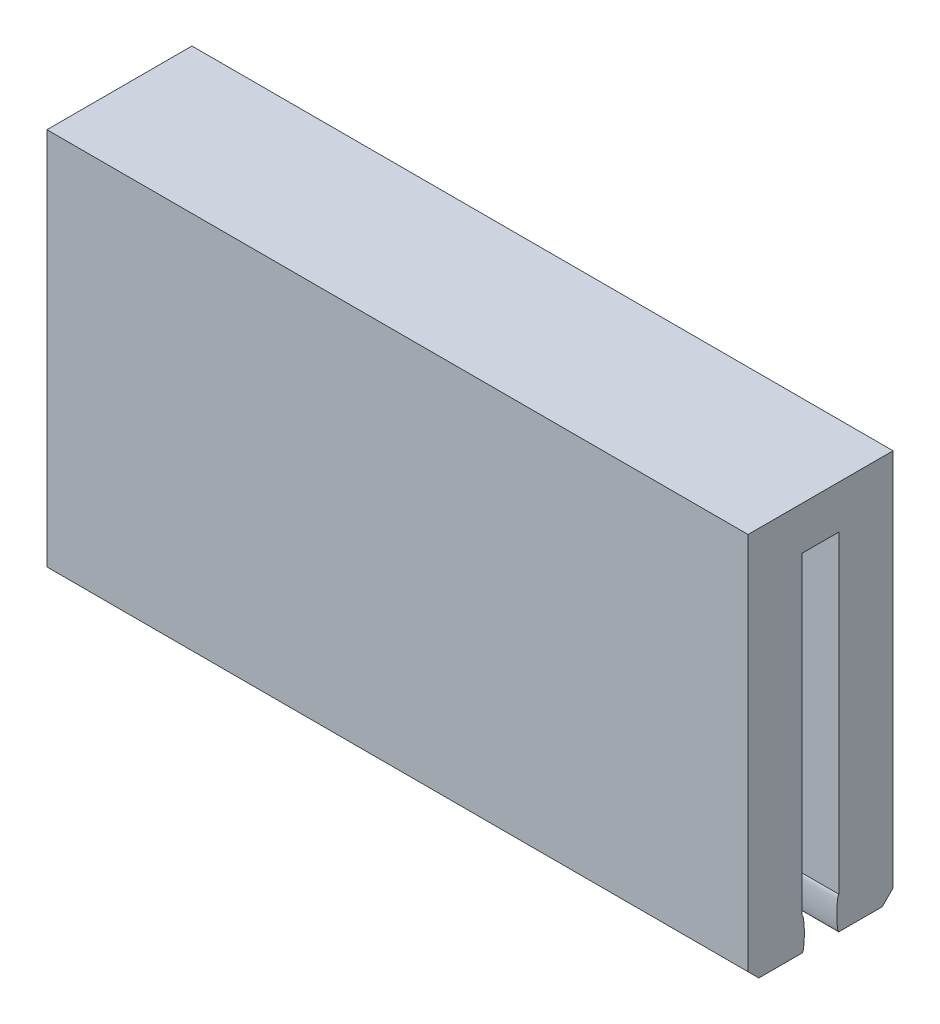
ISO-10303-21;
HEADER;
FILE_DESCRIPTION(('STEP AP214'),'2;1');
FILE_NAME('part.step','',(''),(''),'','','');
FILE_SCHEMA(('AUTOMOTIVE_DESIGN { 1 0 10303 214 1 1 1 1 }'));
ENDSEC;
DATA;
#1=APPLICATION_CONTEXT('core data for automotive mechanical design processes');
#2=APPLICATION_PROTOCOL_DEFINITION('international standard','automotive_design',2000,#1);
#3=PRODUCT_CONTEXT('',#1,'mechanical');
#4=PRODUCT('Part','Part','',(#3));
#5=PRODUCT_RELATED_PRODUCT_CATEGORY('part','',(#4));
#6=PRODUCT_DEFINITION_FORMATION('','',#4);
#7=PRODUCT_DEFINITION_CONTEXT('part definition',#1,'design');
#8=PRODUCT_DEFINITION('design','',#6,#7);
#9=PRODUCT_DEFINITION_SHAPE('','',#8);
#10=(LENGTH_UNIT() NAMED_UNIT(*) SI_UNIT(.MILLI.,.METRE.));
#11=(NAMED_UNIT(*) PLANE_ANGLE_UNIT() SI_UNIT($,.RADIAN.));
#12=(NAMED_UNIT(*) SI_UNIT($,.STERADIAN.) SOLID_ANGLE_UNIT());
#13=UNCERTAINTY_MEASURE_WITH_UNIT(LENGTH_MEASURE(1.E-05),#10,'distance_accuracy_value','');
#14=(GEOMETRIC_REPRESENTATION_CONTEXT(3) GLOBAL_UNCERTAINTY_ASSIGNED_CONTEXT((#13)) GLOBAL_UNIT_ASSIGNED_CONTEXT((#10,
#11,#12)) REPRESENTATION_CONTEXT('',''));
#15=CARTESIAN_POINT('',(0.,0.,0.));
#16=DIRECTION('',(0.,0.,1.));
#17=DIRECTION('',(1.,0.,0.));
#18=AXIS2_PLACEMENT_3D('',#15,#16,#17);
#19=CARTESIAN_POINT('',(0.,16.,0.));
#20=DIRECTION('',(0.,-1.,0.));
#21=DIRECTION('',(0.,0.,-1.));
#22=AXIS2_PLACEMENT_3D('',#19,#20,#21);
#23=PLANE('',#22);
#24=DIRECTION('',(0.,0.,1.));
#25=VECTOR('',#24,1.);
#26=CARTESIAN_POINT('',(-16.2,16.,3.35));
#27=LINE('',#26,#25);
#28=CARTESIAN_POINT('',(-16.2,16.,-0.849999999999999));
#29=VERTEX_POINT('',#28);
#30=CARTESIAN_POINT('',(-16.2,16.,0.850000000000006));
#31=VERTEX_POINT('',#30);
#32=EDGE_CURVE('E496',#29,#31,#27,.T.);
#33=ORIENTED_EDGE('',*,*,#32,.F.);
#34=DIRECTION('',(1.,0.,0.));
#35=VECTOR('',#34,1.);
#36=CARTESIAN_POINT('',(-14.2,16.,-0.849999999999999));
#37=LINE('',#36,#35);
#38=CARTESIAN_POINT('',(-14.2,16.,-0.849999999999999));
#39=VERTEX_POINT('',#38);
#40=EDGE_CURVE('E518',#29,#39,#37,.T.);
#41=ORIENTED_EDGE('',*,*,#40,.T.);
#42=DIRECTION('',(0.,0.,-1.));
#43=VECTOR('',#42,1.);
#44=CARTESIAN_POINT('',(-14.2,16.,-1.35));
#45=LINE('',#44,#43);
#46=CARTESIAN_POINT('',(-14.2,16.,-1.35));
#47=VERTEX_POINT('',#46);
#48=EDGE_CURVE('E523',#39,#47,#45,.T.);
#49=ORIENTED_EDGE('',*,*,#48,.T.);
#50=DIRECTION('',(1.,0.,0.));
#51=VECTOR('',#50,1.);
#52=CARTESIAN_POINT('',(-14.2,16.,-1.35));
#53=LINE('',#52,#51);
#54=CARTESIAN_POINT('',(14.2,16.,-1.35));
#55=VERTEX_POINT('',#54);
#56=EDGE_CURVE('E527',#47,#55,#53,.T.);
#57=ORIENTED_EDGE('',*,*,#56,.T.);
#58=DIRECTION('',(0.,0.,1.));
#59=VECTOR('',#58,1.);
#60=CARTESIAN_POINT('',(14.2,16.,-1.35));
#61=LINE('',#60,#59);
#62=CARTESIAN_POINT('',(14.2,16.,-0.850000000000003));
#63=VERTEX_POINT('',#62);
#64=EDGE_CURVE('E531',#55,#63,#61,.T.);
#65=ORIENTED_EDGE('',*,*,#64,.T.);
#66=DIRECTION('',(1.,0.,0.));
#67=VECTOR('',#66,1.);
#68=CARTESIAN_POINT('',(14.2,16.,-0.850000000000003));
#69=LINE('',#68,#67);
#70=CARTESIAN_POINT('',(16.2,16.,-0.850000000000003));
#71=VERTEX_POINT('',#70);
#72=EDGE_CURVE('E535',#63,#71,#69,.T.);
#73=ORIENTED_EDGE('',*,*,#72,.T.);
#74=DIRECTION('',(0.,0.,-1.));
#75=VECTOR('',#74,1.);
#76=CARTESIAN_POINT('',(16.2,16.,3.35));
#77=LINE('',#76,#75);
#78=CARTESIAN_POINT('',(16.2,16.,0.849999999999999));
#79=VERTEX_POINT('',#78);
#80=EDGE_CURVE('E500',#79,#71,#77,.T.);
#81=ORIENTED_EDGE('',*,*,#80,.F.);
#82=DIRECTION('',(-1.,0.,0.));
#83=VECTOR('',#82,1.);
#84=CARTESIAN_POINT('',(14.2,16.,0.85));
#85=LINE('',#84,#83);
#86=CARTESIAN_POINT('',(14.2,16.,0.85));
#87=VERTEX_POINT('',#86);
#88=EDGE_CURVE('E217',#79,#87,#85,.T.);
#89=ORIENTED_EDGE('',*,*,#88,.T.);
#90=DIRECTION('',(0.,0.,1.));
#91=VECTOR('',#90,1.);
#92=CARTESIAN_POINT('',(14.2,16.,0.85));
#93=LINE('',#92,#91);
#94=CARTESIAN_POINT('',(14.2,16.,1.35));
#95=VERTEX_POINT('',#94);
#96=EDGE_CURVE('E482',#87,#95,#93,.T.);
#97=ORIENTED_EDGE('',*,*,#96,.T.);
#98=DIRECTION('',(-1.,0.,0.));
#99=VECTOR('',#98,1.);
#100=CARTESIAN_POINT('',(14.2,16.,1.35));
#101=LINE('',#100,#99);
#102=CARTESIAN_POINT('',(-14.2,16.,1.35));
#103=VERTEX_POINT('',#102);
#104=EDGE_CURVE('E478',#95,#103,#101,.T.);
#105=ORIENTED_EDGE('',*,*,#104,.T.);
#106=DIRECTION('',(0.,0.,-1.));
#107=VECTOR('',#106,1.);
#108=CARTESIAN_POINT('',(-14.2,16.,0.850000000000009));
#109=LINE('',#108,#107);
#110=CARTESIAN_POINT('',(-14.2,16.,0.850000000000009));
#111=VERTEX_POINT('',#110);
#112=EDGE_CURVE('E474',#103,#111,#109,.T.);
#113=ORIENTED_EDGE('',*,*,#112,.T.);
#114=DIRECTION('',(-1.,0.,0.));
#115=VECTOR('',#114,1.);
#116=CARTESIAN_POINT('',(-14.2,16.,0.850000000000009));
#117=LINE('',#116,#115);
#118=EDGE_CURVE('E456',#111,#31,#117,.T.);
#119=ORIENTED_EDGE('',*,*,#118,.T.);
#120=EDGE_LOOP('',(#33,#41,#49,#57,#65,#73,#81,#89,#97,#105,#113,#119));
#121=FACE_BOUND('',#120,.T.);
#122=ADVANCED_FACE('F45',(#121),#23,.T.);
#123=CARTESIAN_POINT('',(16.2,16.,0.849999999999999));
#124=DIRECTION('',(-1.,0.,0.));
#125=DIRECTION('',(0.,0.,1.));
#126=AXIS2_PLACEMENT_3D('',#123,#124,#125);
#127=PLANE('',#126);
#128=DIRECTION('',(0.,-1.,0.));
#129=VECTOR('',#128,1.);
#130=CARTESIAN_POINT('',(16.2,16.,-0.850000000000003));
#131=LINE('',#130,#129);
#132=CARTESIAN_POINT('',(16.2,1.5,-0.850000000000003));
#133=VERTEX_POINT('',#132);
#134=EDGE_CURVE('E539',#71,#133,#131,.T.);
#135=ORIENTED_EDGE('',*,*,#134,.T.);
#136=CARTESIAN_POINT('',(16.2,0.749999999999999,-0.850000000000003));
#137=DIRECTION('',(1.,0.,0.));
#138=DIRECTION('',(0.,1.,0.));
#139=AXIS2_PLACEMENT_3D('',#136,#137,#138);
#140=ELLIPSE('',#139,0.750000000000002,0.100000000000002);
#141=CARTESIAN_POINT('',(16.2,0.,-0.850000000000003));
#142=VERTEX_POINT('',#141);
#143=EDGE_CURVE('E261',#133,#142,#140,.T.);
#144=ORIENTED_EDGE('',*,*,#143,.T.);
#145=DIRECTION('',(0.,0.,-1.));
#146=VECTOR('',#145,1.);
#147=CARTESIAN_POINT('',(16.2,0.,-3.35));
#148=LINE('',#147,#146);
#149=CARTESIAN_POINT('',(16.2,0.,-2.84999999999999));
#150=VERTEX_POINT('',#149);
#151=EDGE_CURVE('E522',#142,#150,#148,.T.);
#152=ORIENTED_EDGE('',*,*,#151,.T.);
#153=DIRECTION('',(0.,0.707106781186545,-0.70710678118655));
#154=VECTOR('',#153,1.);
#155=CARTESIAN_POINT('',(16.2,0.50000000000003,-3.35000000000002));
#156=LINE('',#155,#154);
#157=CARTESIAN_POINT('',(16.2,0.500000000000007,-3.35));
#158=VERTEX_POINT('',#157);
#159=EDGE_CURVE('E375',#150,#158,#156,.T.);
#160=ORIENTED_EDGE('',*,*,#159,.T.);
#161=DIRECTION('',(0.,-1.,0.));
#162=VECTOR('',#161,1.);
#163=CARTESIAN_POINT('',(16.2,18.,-3.35));
#164=LINE('',#163,#162);
#165=CARTESIAN_POINT('',(16.2,18.,-3.35));
#166=VERTEX_POINT('',#165);
#167=EDGE_CURVE('E470',#166,#158,#164,.T.);
#168=ORIENTED_EDGE('',*,*,#167,.F.);
#169=DIRECTION('',(0.,0.,-1.));
#170=VECTOR('',#169,1.);
#171=CARTESIAN_POINT('',(16.2,18.,3.35));
#172=LINE('',#171,#170);
#173=CARTESIAN_POINT('',(16.2,18.,3.35));
#174=VERTEX_POINT('',#173);
#175=EDGE_CURVE('E499',#174,#166,#172,.T.);
#176=ORIENTED_EDGE('',*,*,#175,.F.);
#177=DIRECTION('',(0.,-1.,0.));
#178=VECTOR('',#177,1.);
#179=CARTESIAN_POINT('',(16.2,16.,3.35));
#180=LINE('',#179,#178);
#181=CARTESIAN_POINT('',(16.2,0.500000000000007,3.35));
#182=VERTEX_POINT('',#181);
#183=EDGE_CURVE('E453',#174,#182,#180,.T.);
#184=ORIENTED_EDGE('',*,*,#183,.T.);
#185=DIRECTION('',(0.,0.707106781186545,0.70710678118655));
#186=VECTOR('',#185,1.);
#187=CARTESIAN_POINT('',(16.2,0.499999999999985,3.34999999999998));
#188=LINE('',#187,#186);
#189=CARTESIAN_POINT('',(16.2,0.,2.84999999999999));
#190=VERTEX_POINT('',#189);
#191=EDGE_CURVE('E383',#182,#190,#188,.F.);
#192=ORIENTED_EDGE('',*,*,#191,.T.);
#193=DIRECTION('',(0.,0.,-1.));
#194=VECTOR('',#193,1.);
#195=CARTESIAN_POINT('',(16.2,0.,0.849999999999999));
#196=LINE('',#195,#194);
#197=CARTESIAN_POINT('',(16.2,0.,0.849999999999999));
#198=VERTEX_POINT('',#197);
#199=EDGE_CURVE('E467',#190,#198,#196,.T.);
#200=ORIENTED_EDGE('',*,*,#199,.T.);
#201=CARTESIAN_POINT('',(16.2,0.75,0.849999999999999));
#202=DIRECTION('',(1.,0.,0.));
#203=DIRECTION('',(0.,1.,0.));
#204=AXIS2_PLACEMENT_3D('',#201,#202,#203);
#205=ELLIPSE('',#204,0.750000000000002,0.1);
#206=CARTESIAN_POINT('',(16.2,1.5,0.849999999999999));
#207=VERTEX_POINT('',#206);
#208=EDGE_CURVE('E271',#198,#207,#205,.T.);
#209=ORIENTED_EDGE('',*,*,#208,.T.);
#210=DIRECTION('',(0.,-1.,0.));
#211=VECTOR('',#210,1.);
#212=CARTESIAN_POINT('',(16.2,16.,0.849999999999999));
#213=LINE('',#212,#211);
#214=EDGE_CURVE('E430',#79,#207,#213,.T.);
#215=ORIENTED_EDGE('',*,*,#214,.F.);
#216=ORIENTED_EDGE('',*,*,#80,.T.);
#217=EDGE_LOOP('',(#135,#144,#152,#160,#168,#176,#184,#192,#200,#209,#215,#216));
#218=FACE_BOUND('',#217,.T.);
#219=ADVANCED_FACE('F315',(#218),#127,.F.);
#220=CARTESIAN_POINT('',(14.2,16.,0.85));
#221=DIRECTION('',(0.,0.,1.));
#222=DIRECTION('',(1.,0.,0.));
#223=AXIS2_PLACEMENT_3D('',#220,#221,#222);
#224=PLANE('',#223);
#225=ORIENTED_EDGE('',*,*,#214,.T.);
#226=DIRECTION('',(1.,0.,0.));
#227=VECTOR('',#226,1.);
#228=CARTESIAN_POINT('',(14.2,1.5,0.85));
#229=LINE('',#228,#227);
#230=CARTESIAN_POINT('',(14.2,1.5,0.85));
#231=VERTEX_POINT('',#230);
#232=EDGE_CURVE('E277',#207,#231,#229,.F.);
#233=ORIENTED_EDGE('',*,*,#232,.T.);
#234=DIRECTION('',(0.,-1.,0.));
#235=VECTOR('',#234,1.);
#236=CARTESIAN_POINT('',(14.2,16.,0.85));
#237=LINE('',#236,#235);
#238=EDGE_CURVE('E433',#87,#231,#237,.T.);
#239=ORIENTED_EDGE('',*,*,#238,.F.);
#240=ORIENTED_EDGE('',*,*,#88,.F.);
#241=EDGE_LOOP('',(#225,#233,#239,#240));
#242=FACE_BOUND('',#241,.T.);
#243=ADVANCED_FACE('F342',(#242),#224,.F.);
#244=CARTESIAN_POINT('',(14.2,16.,0.85));
#245=DIRECTION('',(1.,0.,0.));
#246=DIRECTION('',(0.,0.,-1.));
#247=AXIS2_PLACEMENT_3D('',#244,#245,#246);
#248=PLANE('',#247);
#249=ORIENTED_EDGE('',*,*,#238,.T.);
#250=CARTESIAN_POINT('',(14.2,0.75,0.850000000000002));
#251=DIRECTION('',(1.,0.,0.));
#252=DIRECTION('',(0.,1.,0.));
#253=AXIS2_PLACEMENT_3D('',#250,#251,#252);
#254=ELLIPSE('',#253,0.750000000000002,0.1);
#255=CARTESIAN_POINT('',(14.2,0.,0.850000000000002));
#256=VERTEX_POINT('',#255);
#257=EDGE_CURVE('E272',#256,#231,#254,.T.);
#258=ORIENTED_EDGE('',*,*,#257,.F.);
#259=DIRECTION('',(0.,0.,1.));
#260=VECTOR('',#259,1.);
#261=CARTESIAN_POINT('',(14.2,0.,0.85));
#262=LINE('',#261,#260);
#263=CARTESIAN_POINT('',(14.2,0.,1.85));
#264=VERTEX_POINT('',#263);
#265=EDGE_CURVE('E460',#256,#264,#262,.T.);
#266=ORIENTED_EDGE('',*,*,#265,.T.);
#267=DIRECTION('',(0.,-0.992546151641322,0.121869343405148));
#268=VECTOR('',#267,1.);
#269=CARTESIAN_POINT('',(14.2,15.8833267580078,-0.100227301659347));
#270=LINE('',#269,#268);
#271=CARTESIAN_POINT('',(14.2,4.07217321398729,1.35));
#272=VERTEX_POINT('',#271);
#273=EDGE_CURVE('E407',#264,#272,#270,.F.);
#274=ORIENTED_EDGE('',*,*,#273,.T.);
#275=DIRECTION('',(0.,-1.,0.));
#276=VECTOR('',#275,1.);
#277=CARTESIAN_POINT('',(14.2,16.,1.35));
#278=LINE('',#277,#276);
#279=EDGE_CURVE('E437',#95,#272,#278,.T.);
#280=ORIENTED_EDGE('',*,*,#279,.F.);
#281=ORIENTED_EDGE('',*,*,#96,.F.);
#282=EDGE_LOOP('',(#249,#258,#266,#274,#280,#281));
#283=FACE_BOUND('',#282,.T.);
#284=ADVANCED_FACE('F338',(#283),#248,.F.);
#285=CARTESIAN_POINT('',(14.2,16.,1.35));
#286=DIRECTION('',(0.,0.,1.));
#287=DIRECTION('',(1.,0.,0.));
#288=AXIS2_PLACEMENT_3D('',#285,#286,#287);
#289=PLANE('',#288);
#290=ORIENTED_EDGE('',*,*,#279,.T.);
#291=DIRECTION('',(-1.,0.,0.));
#292=VECTOR('',#291,1.);
#293=CARTESIAN_POINT('',(14.2,4.07217321398729,1.35));
#294=LINE('',#293,#292);
#295=CARTESIAN_POINT('',(-14.2,4.07217321398729,1.35));
#296=VERTEX_POINT('',#295);
#297=EDGE_CURVE('E426',#272,#296,#294,.T.);
#298=ORIENTED_EDGE('',*,*,#297,.T.);
#299=DIRECTION('',(0.,-1.,0.));
#300=VECTOR('',#299,1.);
#301=CARTESIAN_POINT('',(-14.2,16.,1.35));
#302=LINE('',#301,#300);
#303=EDGE_CURVE('E441',#103,#296,#302,.T.);
#304=ORIENTED_EDGE('',*,*,#303,.F.);
#305=ORIENTED_EDGE('',*,*,#104,.F.);
#306=EDGE_LOOP('',(#290,#298,#304,#305));
#307=FACE_BOUND('',#306,.T.);
#308=ADVANCED_FACE('F334',(#307),#289,.F.);
#309=CARTESIAN_POINT('',(-14.2,16.,0.850000000000009));
#310=DIRECTION('',(-1.,0.,0.));
#311=DIRECTION('',(0.,0.,1.));
#312=AXIS2_PLACEMENT_3D('',#309,#310,#311);
#313=PLANE('',#312);
#314=DIRECTION('',(0.,0.,-1.));
#315=VECTOR('',#314,1.);
#316=CARTESIAN_POINT('',(-14.2,0.,0.850000000000009));
#317=LINE('',#316,#315);
#318=CARTESIAN_POINT('',(-14.2,0.,1.85));
#319=VERTEX_POINT('',#318);
#320=CARTESIAN_POINT('',(-14.2,0.,0.850000000000009));
#321=VERTEX_POINT('',#320);
#322=EDGE_CURVE('E226',#319,#321,#317,.T.);
#323=ORIENTED_EDGE('',*,*,#322,.T.);
#324=CARTESIAN_POINT('',(-14.2,0.749999999999999,0.850000000000006));
#325=DIRECTION('',(-1.,0.,0.));
#326=DIRECTION('',(0.,-1.,0.));
#327=AXIS2_PLACEMENT_3D('',#324,#325,#326);
#328=ELLIPSE('',#327,0.750000000000001,0.0999999999999994);
#329=CARTESIAN_POINT('',(-14.2,1.5,0.850000000000009));
#330=VERTEX_POINT('',#329);
#331=EDGE_CURVE('E224',#330,#321,#328,.T.);
#332=ORIENTED_EDGE('',*,*,#331,.F.);
#333=DIRECTION('',(0.,-1.,0.));
#334=VECTOR('',#333,1.);
#335=CARTESIAN_POINT('',(-14.2,16.,0.850000000000009));
#336=LINE('',#335,#334);
#337=EDGE_CURVE('E62',#111,#330,#336,.T.);
#338=ORIENTED_EDGE('',*,*,#337,.F.);
#339=ORIENTED_EDGE('',*,*,#112,.F.);
#340=ORIENTED_EDGE('',*,*,#303,.T.);
#341=DIRECTION('',(0.,0.992546151641322,-0.121869343405148));
#342=VECTOR('',#341,1.);
#343=CARTESIAN_POINT('',(-14.2,15.8833267580078,-0.100227301659344));
#344=LINE('',#343,#342);
#345=EDGE_CURVE('E410',#296,#319,#344,.F.);
#346=ORIENTED_EDGE('',*,*,#345,.T.);
#347=EDGE_LOOP('',(#323,#332,#338,#339,#340,#346));
#348=FACE_BOUND('',#347,.T.);
#349=ADVANCED_FACE('F331',(#348),#313,.F.);
#350=CARTESIAN_POINT('',(-14.2,16.,0.850000000000009));
#351=DIRECTION('',(0.,0.,1.));
#352=DIRECTION('',(1.,0.,0.));
#353=AXIS2_PLACEMENT_3D('',#350,#351,#352);
#354=PLANE('',#353);
#355=ORIENTED_EDGE('',*,*,#337,.T.);
#356=DIRECTION('',(-1.,0.,0.));
#357=VECTOR('',#356,1.);
#358=CARTESIAN_POINT('',(-14.2,1.5,0.850000000000009));
#359=LINE('',#358,#357);
#360=CARTESIAN_POINT('',(-16.2,1.5,0.850000000000004));
#361=VERTEX_POINT('',#360);
#362=EDGE_CURVE('E66',#330,#361,#359,.T.);
#363=ORIENTED_EDGE('',*,*,#362,.T.);
#364=DIRECTION('',(0.,-1.,0.));
#365=VECTOR('',#364,1.);
#366=CARTESIAN_POINT('',(-16.2,16.,0.850000000000004));
#367=LINE('',#366,#365);
#368=EDGE_CURVE('E229',#31,#361,#367,.T.);
#369=ORIENTED_EDGE('',*,*,#368,.F.);
#370=ORIENTED_EDGE('',*,*,#118,.F.);
#371=EDGE_LOOP('',(#355,#363,#369,#370));
#372=FACE_BOUND('',#371,.T.);
#373=ADVANCED_FACE('F328',(#372),#354,.F.);
#374=CARTESIAN_POINT('',(-16.2,16.,3.35));
#375=DIRECTION('',(1.,0.,0.));
#376=DIRECTION('',(0.,0.,-1.));
#377=AXIS2_PLACEMENT_3D('',#374,#375,#376);
#378=PLANE('',#377);
#379=ORIENTED_EDGE('',*,*,#368,.T.);
#380=CARTESIAN_POINT('',(-16.2,0.749999999999999,0.850000000000006));
#381=DIRECTION('',(-1.,0.,0.));
#382=DIRECTION('',(0.,-1.,0.));
#383=AXIS2_PLACEMENT_3D('',#380,#381,#382);
#384=ELLIPSE('',#383,0.750000000000001,0.0999999999999994);
#385=CARTESIAN_POINT('',(-16.2,0.,0.850000000000003));
#386=VERTEX_POINT('',#385);
#387=EDGE_CURVE('E222',#361,#386,#384,.T.);
#388=ORIENTED_EDGE('',*,*,#387,.T.);
#389=DIRECTION('',(0.,0.,1.));
#390=VECTOR('',#389,1.);
#391=CARTESIAN_POINT('',(-16.2,0.,3.35));
#392=LINE('',#391,#390);
#393=CARTESIAN_POINT('',(-16.2,0.,2.84999999999999));
#394=VERTEX_POINT('',#393);
#395=EDGE_CURVE('E206',#386,#394,#392,.T.);
#396=ORIENTED_EDGE('',*,*,#395,.T.);
#397=DIRECTION('',(0.,-0.707106781186545,-0.70710678118655));
#398=VECTOR('',#397,1.);
#399=CARTESIAN_POINT('',(-16.2,0.500000000000007,3.35));
#400=LINE('',#399,#398);
#401=CARTESIAN_POINT('',(-16.2,0.500000000000007,3.35));
#402=VERTEX_POINT('',#401);
#403=EDGE_CURVE('E395',#394,#402,#400,.F.);
#404=ORIENTED_EDGE('',*,*,#403,.T.);
#405=DIRECTION('',(0.,-1.,0.));
#406=VECTOR('',#405,1.);
#407=CARTESIAN_POINT('',(-16.2,16.,3.35));
#408=LINE('',#407,#406);
#409=CARTESIAN_POINT('',(-16.2,18.,3.35));
#410=VERTEX_POINT('',#409);
#411=EDGE_CURVE('E449',#410,#402,#408,.T.);
#412=ORIENTED_EDGE('',*,*,#411,.F.);
#413=DIRECTION('',(0.,0.,1.));
#414=VECTOR('',#413,1.);
#415=CARTESIAN_POINT('',(-16.2,18.,3.35));
#416=LINE('',#415,#414);
#417=CARTESIAN_POINT('',(-16.2,18.,-3.35));
#418=VERTEX_POINT('',#417);
#419=EDGE_CURVE('E508',#418,#410,#416,.T.);
#420=ORIENTED_EDGE('',*,*,#419,.F.);
#421=DIRECTION('',(0.,-1.,0.));
#422=VECTOR('',#421,1.);
#423=CARTESIAN_POINT('',(-16.2,18.,-3.35));
#424=LINE('',#423,#422);
#425=CARTESIAN_POINT('',(-16.2,0.500000000000007,-3.35));
#426=VERTEX_POINT('',#425);
#427=EDGE_CURVE('E491',#418,#426,#424,.T.);
#428=ORIENTED_EDGE('',*,*,#427,.T.);
#429=DIRECTION('',(0.,-0.707106781186545,0.70710678118655));
#430=VECTOR('',#429,1.);
#431=CARTESIAN_POINT('',(-16.2,0.500000000000007,-3.35));
#432=LINE('',#431,#430);
#433=CARTESIAN_POINT('',(-16.2,0.,-2.84999999999999));
#434=VERTEX_POINT('',#433);
#435=EDGE_CURVE('E392',#426,#434,#432,.T.);
#436=ORIENTED_EDGE('',*,*,#435,.T.);
#437=DIRECTION('',(0.,0.,1.));
#438=VECTOR('',#437,1.);
#439=CARTESIAN_POINT('',(-16.2,0.,-3.35));
#440=LINE('',#439,#438);
#441=CARTESIAN_POINT('',(-16.2,0.,-0.849999999999999));
#442=VERTEX_POINT('',#441);
#443=EDGE_CURVE('E504',#434,#442,#440,.T.);
#444=ORIENTED_EDGE('',*,*,#443,.T.);
#445=CARTESIAN_POINT('',(-16.2,0.749999999999999,-0.849999999999999));
#446=DIRECTION('',(-1.,0.,0.));
#447=DIRECTION('',(0.,-1.,0.));
#448=AXIS2_PLACEMENT_3D('',#445,#446,#447);
#449=ELLIPSE('',#448,0.749999999999999,0.100000000000001);
#450=CARTESIAN_POINT('',(-16.2,1.5,-0.849999999999999));
#451=VERTEX_POINT('',#450);
#452=EDGE_CURVE('E234',#442,#451,#449,.T.);
#453=ORIENTED_EDGE('',*,*,#452,.T.);
#454=DIRECTION('',(0.,-1.,0.));
#455=VECTOR('',#454,1.);
#456=CARTESIAN_POINT('',(-16.2,16.,-0.849999999999999));
#457=LINE('',#456,#455);
#458=EDGE_CURVE('E576',#29,#451,#457,.T.);
#459=ORIENTED_EDGE('',*,*,#458,.F.);
#460=ORIENTED_EDGE('',*,*,#32,.T.);
#461=EDGE_LOOP('',(#379,#388,#396,#404,#412,#420,#428,#436,#444,#453,#459,#460));
#462=FACE_BOUND('',#461,.T.);
#463=ADVANCED_FACE('F228',(#462),#378,.F.);
#464=CARTESIAN_POINT('',(-16.2,16.,3.35));
#465=DIRECTION('',(0.,0.,-1.));
#466=DIRECTION('',(-1.,0.,0.));
#467=AXIS2_PLACEMENT_3D('',#464,#465,#466);
#468=PLANE('',#467);
#469=ORIENTED_EDGE('',*,*,#411,.T.);
#470=DIRECTION('',(1.,0.,0.));
#471=VECTOR('',#470,1.);
#472=CARTESIAN_POINT('',(-16.2,0.500000000000007,3.35));
#473=LINE('',#472,#471);
#474=EDGE_CURVE('E55',#402,#182,#473,.T.);
#475=ORIENTED_EDGE('',*,*,#474,.T.);
#476=ORIENTED_EDGE('',*,*,#183,.F.);
#477=DIRECTION('',(1.,0.,0.));
#478=VECTOR('',#477,1.);
#479=CARTESIAN_POINT('',(-16.2,18.,3.35));
#480=LINE('',#479,#478);
#481=EDGE_CURVE('E495',#410,#174,#480,.T.);
#482=ORIENTED_EDGE('',*,*,#481,.F.);
#483=EDGE_LOOP('',(#469,#475,#476,#482));
#484=FACE_BOUND('',#483,.T.);
#485=ADVANCED_FACE('F322',(#484),#468,.F.);
#486=CARTESIAN_POINT('',(0.,0.,0.));
#487=DIRECTION('',(0.,1.,0.));
#488=DIRECTION('',(0.,0.,1.));
#489=AXIS2_PLACEMENT_3D('',#486,#487,#488);
#490=PLANE('',#489);
#491=ORIENTED_EDGE('',*,*,#199,.F.);
#492=DIRECTION('',(-1.,0.,0.));
#493=VECTOR('',#492,1.);
#494=CARTESIAN_POINT('',(0.,0.,2.84999999999999));
#495=LINE('',#494,#493);
#496=EDGE_CURVE('E11',#190,#394,#495,.T.);
#497=ORIENTED_EDGE('',*,*,#496,.T.);
#498=ORIENTED_EDGE('',*,*,#395,.F.);
#499=DIRECTION('',(-1.,0.,0.));
#500=VECTOR('',#499,1.);
#501=CARTESIAN_POINT('',(-14.2,0.,0.850000000000009));
#502=LINE('',#501,#500);
#503=EDGE_CURVE('E210',#321,#386,#502,.T.);
#504=ORIENTED_EDGE('',*,*,#503,.F.);
#505=ORIENTED_EDGE('',*,*,#322,.F.);
#506=DIRECTION('',(1.,0.,0.));
#507=VECTOR('',#506,1.);
#508=CARTESIAN_POINT('',(0.,0.,1.85));
#509=LINE('',#508,#507);
#510=EDGE_CURVE('E422',#319,#264,#509,.T.);
#511=ORIENTED_EDGE('',*,*,#510,.T.);
#512=ORIENTED_EDGE('',*,*,#265,.F.);
#513=DIRECTION('',(-1.,0.,0.));
#514=VECTOR('',#513,1.);
#515=CARTESIAN_POINT('',(14.2,0.,0.85));
#516=LINE('',#515,#514);
#517=EDGE_CURVE('E463',#198,#256,#516,.T.);
#518=ORIENTED_EDGE('',*,*,#517,.F.);
#519=EDGE_LOOP('',(#491,#497,#498,#504,#505,#511,#512,#518));
#520=FACE_BOUND('',#519,.T.);
#521=ADVANCED_FACE('F209',(#520),#490,.F.);
#522=CARTESIAN_POINT('',(-16.2,18.,-3.35));
#523=DIRECTION('',(0.,0.,1.));
#524=DIRECTION('',(1.,0.,0.));
#525=AXIS2_PLACEMENT_3D('',#522,#523,#524);
#526=PLANE('',#525);
#527=ORIENTED_EDGE('',*,*,#167,.T.);
#528=DIRECTION('',(-1.,0.,0.));
#529=VECTOR('',#528,1.);
#530=CARTESIAN_POINT('',(-16.2,0.500000000000007,-3.35));
#531=LINE('',#530,#529);
#532=EDGE_CURVE('E378',#158,#426,#531,.T.);
#533=ORIENTED_EDGE('',*,*,#532,.T.);
#534=ORIENTED_EDGE('',*,*,#427,.F.);
#535=DIRECTION('',(-1.,0.,0.));
#536=VECTOR('',#535,1.);
#537=CARTESIAN_POINT('',(-16.2,18.,-3.35));
#538=LINE('',#537,#536);
#539=EDGE_CURVE('E512',#166,#418,#538,.T.);
#540=ORIENTED_EDGE('',*,*,#539,.F.);
#541=EDGE_LOOP('',(#527,#533,#534,#540));
#542=FACE_BOUND('',#541,.T.);
#543=ADVANCED_FACE('F311',(#542),#526,.F.);
#544=CARTESIAN_POINT('',(0.,18.,0.));
#545=DIRECTION('',(0.,-1.,0.));
#546=DIRECTION('',(0.,0.,-1.));
#547=AXIS2_PLACEMENT_3D('',#544,#545,#546);
#548=PLANE('',#547);
#549=ORIENTED_EDGE('',*,*,#175,.T.);
#550=ORIENTED_EDGE('',*,*,#539,.T.);
#551=ORIENTED_EDGE('',*,*,#419,.T.);
#552=ORIENTED_EDGE('',*,*,#481,.T.);
#553=EDGE_LOOP('',(#549,#550,#551,#552));
#554=FACE_BOUND('',#553,.T.);
#555=ADVANCED_FACE('F287',(#554),#548,.F.);
#556=CARTESIAN_POINT('',(-14.2,16.,-0.849999999999999));
#557=DIRECTION('',(0.,0.,-1.));
#558=DIRECTION('',(-1.,0.,0.));
#559=AXIS2_PLACEMENT_3D('',#556,#557,#558);
#560=PLANE('',#559);
#561=ORIENTED_EDGE('',*,*,#458,.T.);
#562=DIRECTION('',(-1.,0.,0.));
#563=VECTOR('',#562,1.);
#564=CARTESIAN_POINT('',(-14.2,1.5,-0.849999999999999));
#565=LINE('',#564,#563);
#566=CARTESIAN_POINT('',(-14.2,1.5,-0.849999999999999));
#567=VERTEX_POINT('',#566);
#568=EDGE_CURVE('E254',#451,#567,#565,.F.);
#569=ORIENTED_EDGE('',*,*,#568,.T.);
#570=DIRECTION('',(0.,-1.,0.));
#571=VECTOR('',#570,1.);
#572=CARTESIAN_POINT('',(-14.2,16.,-0.849999999999999));
#573=LINE('',#572,#571);
#574=EDGE_CURVE('E572',#39,#567,#573,.T.);
#575=ORIENTED_EDGE('',*,*,#574,.F.);
#576=ORIENTED_EDGE('',*,*,#40,.F.);
#577=EDGE_LOOP('',(#561,#569,#575,#576));
#578=FACE_BOUND('',#577,.T.);
#579=ADVANCED_FACE('F283',(#578),#560,.F.);
#580=CARTESIAN_POINT('',(-14.2,16.,-1.35));
#581=DIRECTION('',(-1.,0.,0.));
#582=DIRECTION('',(0.,0.,1.));
#583=AXIS2_PLACEMENT_3D('',#580,#581,#582);
#584=PLANE('',#583);
#585=ORIENTED_EDGE('',*,*,#574,.T.);
#586=CARTESIAN_POINT('',(-14.2,0.749999999999999,-0.849999999999999));
#587=DIRECTION('',(-1.,0.,0.));
#588=DIRECTION('',(0.,-1.,0.));
#589=AXIS2_PLACEMENT_3D('',#586,#587,#588);
#590=ELLIPSE('',#589,0.749999999999999,0.100000000000001);
#591=CARTESIAN_POINT('',(-14.2,0.,-0.849999999999999));
#592=VERTEX_POINT('',#591);
#593=EDGE_CURVE('E249',#592,#567,#590,.T.);
#594=ORIENTED_EDGE('',*,*,#593,.F.);
#595=DIRECTION('',(0.,0.,-1.));
#596=VECTOR('',#595,1.);
#597=CARTESIAN_POINT('',(-14.2,0.,-1.35));
#598=LINE('',#597,#596);
#599=CARTESIAN_POINT('',(-14.2,0.,-1.85));
#600=VERTEX_POINT('',#599);
#601=EDGE_CURVE('E546',#592,#600,#598,.T.);
#602=ORIENTED_EDGE('',*,*,#601,.T.);
#603=DIRECTION('',(0.,0.992546151641322,0.121869343405148));
#604=VECTOR('',#603,1.);
#605=CARTESIAN_POINT('',(-14.2,15.8228462841079,0.0928012332283472));
#606=LINE('',#605,#604);
#607=CARTESIAN_POINT('',(-14.2,4.07217321398729,-1.35));
#608=VERTEX_POINT('',#607);
#609=EDGE_CURVE('E400',#600,#608,#606,.T.);
#610=ORIENTED_EDGE('',*,*,#609,.T.);
#611=DIRECTION('',(0.,-1.,0.));
#612=VECTOR('',#611,1.);
#613=CARTESIAN_POINT('',(-14.2,16.,-1.35));
#614=LINE('',#613,#612);
#615=EDGE_CURVE('E568',#47,#608,#614,.T.);
#616=ORIENTED_EDGE('',*,*,#615,.F.);
#617=ORIENTED_EDGE('',*,*,#48,.F.);
#618=EDGE_LOOP('',(#585,#594,#602,#610,#616,#617));
#619=FACE_BOUND('',#618,.T.);
#620=ADVANCED_FACE('F286',(#619),#584,.F.);
#621=CARTESIAN_POINT('',(-14.2,16.,-1.35));
#622=DIRECTION('',(0.,0.,-1.));
#623=DIRECTION('',(-1.,0.,0.));
#624=AXIS2_PLACEMENT_3D('',#621,#622,#623);
#625=PLANE('',#624);
#626=ORIENTED_EDGE('',*,*,#615,.T.);
#627=DIRECTION('',(1.,0.,0.));
#628=VECTOR('',#627,1.);
#629=CARTESIAN_POINT('',(14.2,4.07217321398729,-1.35));
#630=LINE('',#629,#628);
#631=CARTESIAN_POINT('',(14.2,4.07217321398729,-1.35));
#632=VERTEX_POINT('',#631);
#633=EDGE_CURVE('E418',#608,#632,#630,.T.);
#634=ORIENTED_EDGE('',*,*,#633,.T.);
#635=DIRECTION('',(0.,-1.,0.));
#636=VECTOR('',#635,1.);
#637=CARTESIAN_POINT('',(14.2,16.,-1.35));
#638=LINE('',#637,#636);
#639=EDGE_CURVE('E564',#55,#632,#638,.T.);
#640=ORIENTED_EDGE('',*,*,#639,.F.);
#641=ORIENTED_EDGE('',*,*,#56,.F.);
#642=EDGE_LOOP('',(#626,#634,#640,#641));
#643=FACE_BOUND('',#642,.T.);
#644=ADVANCED_FACE('F291',(#643),#625,.F.);
#645=CARTESIAN_POINT('',(14.2,16.,-1.35));
#646=DIRECTION('',(1.,0.,0.));
#647=DIRECTION('',(0.,0.,-1.));
#648=AXIS2_PLACEMENT_3D('',#645,#646,#647);
#649=PLANE('',#648);
#650=DIRECTION('',(0.,0.,1.));
#651=VECTOR('',#650,1.);
#652=CARTESIAN_POINT('',(14.2,0.,-1.35));
#653=LINE('',#652,#651);
#654=CARTESIAN_POINT('',(14.2,0.,-1.85));
#655=VERTEX_POINT('',#654);
#656=CARTESIAN_POINT('',(14.2,0.,-0.850000000000003));
#657=VERTEX_POINT('',#656);
#658=EDGE_CURVE('E549',#655,#657,#653,.T.);
#659=ORIENTED_EDGE('',*,*,#658,.T.);
#660=CARTESIAN_POINT('',(14.2,0.749999999999999,-0.85));
#661=DIRECTION('',(1.,0.,0.));
#662=DIRECTION('',(0.,1.,0.));
#663=AXIS2_PLACEMENT_3D('',#660,#661,#662);
#664=ELLIPSE('',#663,0.750000000000002,0.100000000000002);
#665=CARTESIAN_POINT('',(14.2,1.5,-0.850000000000003));
#666=VERTEX_POINT('',#665);
#667=EDGE_CURVE('E260',#666,#657,#664,.T.);
#668=ORIENTED_EDGE('',*,*,#667,.F.);
#669=DIRECTION('',(0.,-1.,0.));
#670=VECTOR('',#669,1.);
#671=CARTESIAN_POINT('',(14.2,16.,-0.850000000000003));
#672=LINE('',#671,#670);
#673=EDGE_CURVE('E561',#63,#666,#672,.T.);
#674=ORIENTED_EDGE('',*,*,#673,.F.);
#675=ORIENTED_EDGE('',*,*,#64,.F.);
#676=ORIENTED_EDGE('',*,*,#639,.T.);
#677=DIRECTION('',(0.,-0.992546151641322,-0.121869343405148));
#678=VECTOR('',#677,1.);
#679=CARTESIAN_POINT('',(14.2,15.8228462841079,0.0928012332283472));
#680=LINE('',#679,#678);
#681=EDGE_CURVE('E403',#632,#655,#680,.T.);
#682=ORIENTED_EDGE('',*,*,#681,.T.);
#683=EDGE_LOOP('',(#659,#668,#674,#675,#676,#682));
#684=FACE_BOUND('',#683,.T.);
#685=ADVANCED_FACE('F295',(#684),#649,.F.);
#686=CARTESIAN_POINT('',(14.2,16.,-0.850000000000003));
#687=DIRECTION('',(0.,0.,-1.));
#688=DIRECTION('',(-1.,0.,0.));
#689=AXIS2_PLACEMENT_3D('',#686,#687,#688);
#690=PLANE('',#689);
#691=ORIENTED_EDGE('',*,*,#673,.T.);
#692=DIRECTION('',(1.,0.,0.));
#693=VECTOR('',#692,1.);
#694=CARTESIAN_POINT('',(14.2,1.5,-0.850000000000003));
#695=LINE('',#694,#693);
#696=EDGE_CURVE('E264',#666,#133,#695,.T.);
#697=ORIENTED_EDGE('',*,*,#696,.T.);
#698=ORIENTED_EDGE('',*,*,#134,.F.);
#699=ORIENTED_EDGE('',*,*,#72,.F.);
#700=EDGE_LOOP('',(#691,#697,#698,#699));
#701=FACE_BOUND('',#700,.T.);
#702=ADVANCED_FACE('F299',(#701),#690,.F.);
#703=CARTESIAN_POINT('',(0.,0.,0.));
#704=DIRECTION('',(0.,-1.,0.));
#705=DIRECTION('',(0.,0.,-1.));
#706=AXIS2_PLACEMENT_3D('',#703,#704,#705);
#707=PLANE('',#706);
#708=ORIENTED_EDGE('',*,*,#443,.F.);
#709=DIRECTION('',(1.,0.,0.));
#710=VECTOR('',#709,1.);
#711=CARTESIAN_POINT('',(16.2,0.,-2.84999999999999));
#712=LINE('',#711,#710);
#713=EDGE_CURVE('E376',#434,#150,#712,.T.);
#714=ORIENTED_EDGE('',*,*,#713,.T.);
#715=ORIENTED_EDGE('',*,*,#151,.F.);
#716=DIRECTION('',(1.,0.,0.));
#717=VECTOR('',#716,1.);
#718=CARTESIAN_POINT('',(14.2,0.,-0.850000000000003));
#719=LINE('',#718,#717);
#720=EDGE_CURVE('E552',#657,#142,#719,.T.);
#721=ORIENTED_EDGE('',*,*,#720,.F.);
#722=ORIENTED_EDGE('',*,*,#658,.F.);
#723=DIRECTION('',(-1.,0.,0.));
#724=VECTOR('',#723,1.);
#725=CARTESIAN_POINT('',(-14.2,0.,-1.85));
#726=LINE('',#725,#724);
#727=EDGE_CURVE('E414',#655,#600,#726,.T.);
#728=ORIENTED_EDGE('',*,*,#727,.T.);
#729=ORIENTED_EDGE('',*,*,#601,.F.);
#730=DIRECTION('',(1.,0.,0.));
#731=VECTOR('',#730,1.);
#732=CARTESIAN_POINT('',(-14.2,0.,-0.849999999999999));
#733=LINE('',#732,#731);
#734=EDGE_CURVE('E542',#442,#592,#733,.T.);
#735=ORIENTED_EDGE('',*,*,#734,.F.);
#736=EDGE_LOOP('',(#708,#714,#715,#721,#722,#728,#729,#735));
#737=FACE_BOUND('',#736,.T.);
#738=ADVANCED_FACE('F303',(#737),#707,.T.);
#739=CARTESIAN_POINT('',(14.2,4.07217321398729,1.35));
#740=DIRECTION('',(0.,0.121869343405148,0.992546151641322));
#741=DIRECTION('',(-1.,0.,0.));
#742=AXIS2_PLACEMENT_3D('',#739,#740,#741);
#743=PLANE('',#742);
#744=ORIENTED_EDGE('',*,*,#273,.F.);
#745=ORIENTED_EDGE('',*,*,#510,.F.);
#746=ORIENTED_EDGE('',*,*,#345,.F.);
#747=ORIENTED_EDGE('',*,*,#297,.F.);
#748=EDGE_LOOP('',(#744,#745,#746,#747));
#749=FACE_BOUND('',#748,.T.);
#750=ADVANCED_FACE('F307',(#749),#743,.F.);
#751=CARTESIAN_POINT('',(-14.2,4.07217321398729,-1.35));
#752=DIRECTION('',(0.,-0.121869343405148,0.992546151641322));
#753=DIRECTION('',(-1.,0.,0.));
#754=AXIS2_PLACEMENT_3D('',#751,#752,#753);
#755=PLANE('',#754);
#756=ORIENTED_EDGE('',*,*,#609,.F.);
#757=ORIENTED_EDGE('',*,*,#727,.F.);
#758=ORIENTED_EDGE('',*,*,#681,.F.);
#759=ORIENTED_EDGE('',*,*,#633,.F.);
#760=EDGE_LOOP('',(#756,#757,#758,#759));
#761=FACE_BOUND('',#760,.T.);
#762=ADVANCED_FACE('F356',(#761),#755,.T.);
#763=CARTESIAN_POINT('',(-16.2,0.500000000000007,-3.35));
#764=DIRECTION('',(0.,-0.70710678118655,-0.707106781186545));
#765=DIRECTION('',(1.,0.,0.));
#766=AXIS2_PLACEMENT_3D('',#763,#764,#765);
#767=PLANE('',#766);
#768=ORIENTED_EDGE('',*,*,#159,.F.);
#769=ORIENTED_EDGE('',*,*,#713,.F.);
#770=ORIENTED_EDGE('',*,*,#435,.F.);
#771=ORIENTED_EDGE('',*,*,#532,.F.);
#772=EDGE_LOOP('',(#768,#769,#770,#771));
#773=FACE_BOUND('',#772,.T.);
#774=ADVANCED_FACE('F362',(#773),#767,.T.);
#775=CARTESIAN_POINT('',(-16.2,0.500000000000007,3.35));
#776=DIRECTION('',(0.,0.70710678118655,-0.707106781186545));
#777=DIRECTION('',(1.,0.,0.));
#778=AXIS2_PLACEMENT_3D('',#775,#776,#777);
#779=PLANE('',#778);
#780=ORIENTED_EDGE('',*,*,#403,.F.);
#781=ORIENTED_EDGE('',*,*,#496,.F.);
#782=ORIENTED_EDGE('',*,*,#191,.F.);
#783=ORIENTED_EDGE('',*,*,#474,.F.);
#784=EDGE_LOOP('',(#780,#781,#782,#783));
#785=FACE_BOUND('',#784,.T.);
#786=ADVANCED_FACE('F48',(#785),#779,.F.);
#787=DIRECTION('',(1.,0.,0.));
#788=VECTOR('',#787,1.);
#789=SURFACE_OF_LINEAR_EXTRUSION('',#254,#788);
#790=ORIENTED_EDGE('',*,*,#232,.F.);
#791=ORIENTED_EDGE('',*,*,#208,.F.);
#792=ORIENTED_EDGE('',*,*,#517,.T.);
#793=ORIENTED_EDGE('',*,*,#257,.T.);
#794=EDGE_LOOP('',(#790,#791,#792,#793));
#795=FACE_BOUND('',#794,.T.);
#796=ADVANCED_FACE('F279',(#795),#789,.T.);
#797=DIRECTION('',(1.,0.,0.));
#798=VECTOR('',#797,1.);
#799=SURFACE_OF_LINEAR_EXTRUSION('',#664,#798);
#800=ORIENTED_EDGE('',*,*,#696,.F.);
#801=ORIENTED_EDGE('',*,*,#667,.T.);
#802=ORIENTED_EDGE('',*,*,#720,.T.);
#803=ORIENTED_EDGE('',*,*,#143,.F.);
#804=EDGE_LOOP('',(#800,#801,#802,#803));
#805=FACE_BOUND('',#804,.T.);
#806=ADVANCED_FACE('F245',(#805),#799,.T.);
#807=DIRECTION('',(-1.,0.,0.));
#808=VECTOR('',#807,1.);
#809=SURFACE_OF_LINEAR_EXTRUSION('',#590,#808);
#810=ORIENTED_EDGE('',*,*,#568,.F.);
#811=ORIENTED_EDGE('',*,*,#452,.F.);
#812=ORIENTED_EDGE('',*,*,#734,.T.);
#813=ORIENTED_EDGE('',*,*,#593,.T.);
#814=EDGE_LOOP('',(#810,#811,#812,#813));
#815=FACE_BOUND('',#814,.T.);
#816=ADVANCED_FACE('F242',(#815),#809,.T.);
#817=DIRECTION('',(-1.,0.,0.));
#818=VECTOR('',#817,1.);
#819=SURFACE_OF_LINEAR_EXTRUSION('',#328,#818);
#820=ORIENTED_EDGE('',*,*,#362,.F.);
#821=ORIENTED_EDGE('',*,*,#331,.T.);
#822=ORIENTED_EDGE('',*,*,#503,.T.);
#823=ORIENTED_EDGE('',*,*,#387,.F.);
#824=EDGE_LOOP('',(#820,#821,#822,#823));
#825=FACE_BOUND('',#824,.T.);
#826=ADVANCED_FACE('F221',(#825),#819,.T.);
#827=CLOSED_SHELL('',(#122,#219,#243,#284,#308,#349,#373,#463,#485,#521,#543,#555,#579,#620,
#644,#685,#702,#738,#750,#762,#774,#786,#796,#806,#816,#826));
#828=MANIFOLD_SOLID_BREP('B2',#827);
#829=ADVANCED_BREP_SHAPE_REPRESENTATION('',(#18,#828),#14);
#830=SHAPE_DEFINITION_REPRESENTATION(#9,#829);
ENDSEC;
END-ISO-10303-21;
